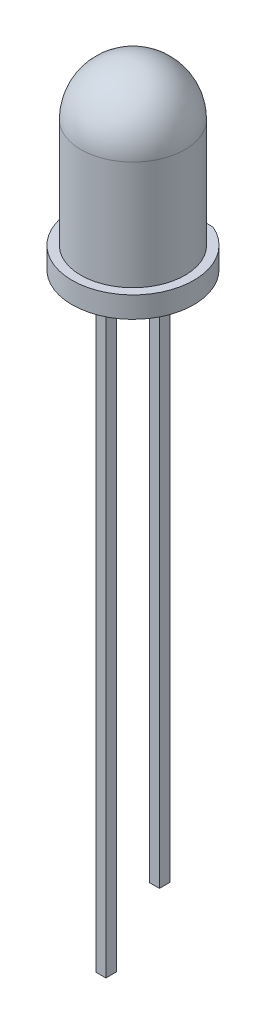
ISO-10303-21;
HEADER;
FILE_DESCRIPTION(('STEP AP214'),'2;1');
FILE_NAME('part.step','',(''),(''),'','','');
FILE_SCHEMA(('AUTOMOTIVE_DESIGN { 1 0 10303 214 1 1 1 1 }'));
ENDSEC;
DATA;
#1=APPLICATION_CONTEXT('core data for automotive mechanical design processes');
#2=APPLICATION_PROTOCOL_DEFINITION('international standard','automotive_design',2000,#1);
#3=PRODUCT_CONTEXT('',#1,'mechanical');
#4=PRODUCT('Part','Part','',(#3));
#5=PRODUCT_RELATED_PRODUCT_CATEGORY('part','',(#4));
#6=PRODUCT_DEFINITION_FORMATION('','',#4);
#7=PRODUCT_DEFINITION_CONTEXT('part definition',#1,'design');
#8=PRODUCT_DEFINITION('design','',#6,#7);
#9=PRODUCT_DEFINITION_SHAPE('','',#8);
#10=(LENGTH_UNIT() NAMED_UNIT(*) SI_UNIT(.MILLI.,.METRE.));
#11=(NAMED_UNIT(*) PLANE_ANGLE_UNIT() SI_UNIT($,.RADIAN.));
#12=(NAMED_UNIT(*) SI_UNIT($,.STERADIAN.) SOLID_ANGLE_UNIT());
#13=UNCERTAINTY_MEASURE_WITH_UNIT(LENGTH_MEASURE(1.E-05),#10,'distance_accuracy_value','');
#14=(GEOMETRIC_REPRESENTATION_CONTEXT(3) GLOBAL_UNCERTAINTY_ASSIGNED_CONTEXT((#13)) GLOBAL_UNIT_ASSIGNED_CONTEXT((#10,
#11,#12)) REPRESENTATION_CONTEXT('',''));
#15=CARTESIAN_POINT('',(0.,0.,0.));
#16=DIRECTION('',(0.,0.,1.));
#17=DIRECTION('',(1.,0.,0.));
#18=AXIS2_PLACEMENT_3D('',#15,#16,#17);
#19=CARTESIAN_POINT('',(0.,0.,0.));
#20=DIRECTION('',(0.,1.,0.));
#21=DIRECTION('',(0.,0.,1.));
#22=AXIS2_PLACEMENT_3D('',#19,#20,#21);
#23=PLANE('',#22);
#24=DIRECTION('',(0.,0.,1.));
#25=VECTOR('',#24,1.);
#26=CARTESIAN_POINT('',(0.235000000000001,0.,-1.515));
#27=LINE('',#26,#25);
#28=CARTESIAN_POINT('',(0.235000000000001,0.,-1.515));
#29=VERTEX_POINT('',#28);
#30=CARTESIAN_POINT('',(0.235000000000001,0.,-1.015));
#31=VERTEX_POINT('',#30);
#32=EDGE_CURVE('E128',#29,#31,#27,.T.);
#33=ORIENTED_EDGE('',*,*,#32,.F.);
#34=DIRECTION('',(1.,0.,0.));
#35=VECTOR('',#34,1.);
#36=CARTESIAN_POINT('',(-0.234999999999999,0.,-1.515));
#37=LINE('',#36,#35);
#38=CARTESIAN_POINT('',(-0.234999999999999,0.,-1.515));
#39=VERTEX_POINT('',#38);
#40=EDGE_CURVE('E176',#39,#29,#37,.T.);
#41=ORIENTED_EDGE('',*,*,#40,.F.);
#42=DIRECTION('',(0.,0.,-1.));
#43=VECTOR('',#42,1.);
#44=CARTESIAN_POINT('',(-0.234999999999999,0.,-1.515));
#45=LINE('',#44,#43);
#46=CARTESIAN_POINT('',(-0.234999999999999,0.,-1.015));
#47=VERTEX_POINT('',#46);
#48=EDGE_CURVE('E193',#47,#39,#45,.T.);
#49=ORIENTED_EDGE('',*,*,#48,.F.);
#50=DIRECTION('',(-1.,0.,0.));
#51=VECTOR('',#50,1.);
#52=CARTESIAN_POINT('',(-0.234999999999999,0.,-1.015));
#53=LINE('',#52,#51);
#54=EDGE_CURVE('E189',#31,#47,#53,.T.);
#55=ORIENTED_EDGE('',*,*,#54,.F.);
#56=EDGE_LOOP('',(#33,#41,#49,#55));
#57=FACE_BOUND('',#56,.T.);
#58=CARTESIAN_POINT('',(0.,0.,0.));
#59=DIRECTION('',(0.,1.,0.));
#60=DIRECTION('',(0.,0.,1.));
#61=AXIS2_PLACEMENT_3D('',#58,#59,#60);
#62=CIRCLE('',#61,2.875);
#63=CARTESIAN_POINT('',(-1.1499565209172,0.,-2.635));
#64=VERTEX_POINT('',#63);
#65=CARTESIAN_POINT('',(1.1499565209172,0.,-2.635));
#66=VERTEX_POINT('',#65);
#67=EDGE_CURVE('E218',#64,#66,#62,.T.);
#68=ORIENTED_EDGE('',*,*,#67,.F.);
#69=DIRECTION('',(-1.,0.,0.));
#70=VECTOR('',#69,1.);
#71=CARTESIAN_POINT('',(-1.1499565209172,0.,-2.635));
#72=LINE('',#71,#70);
#73=EDGE_CURVE('E225',#66,#64,#72,.T.);
#74=ORIENTED_EDGE('',*,*,#73,.F.);
#75=EDGE_LOOP('',(#68,#74));
#76=FACE_BOUND('',#75,.T.);
#77=DIRECTION('',(0.,0.,-1.));
#78=VECTOR('',#77,1.);
#79=CARTESIAN_POINT('',(-0.234999999999999,0.,1.515));
#80=LINE('',#79,#78);
#81=CARTESIAN_POINT('',(-0.234999999999999,0.,1.515));
#82=VERTEX_POINT('',#81);
#83=CARTESIAN_POINT('',(-0.234999999999999,0.,1.015));
#84=VERTEX_POINT('',#83);
#85=EDGE_CURVE('E125',#82,#84,#80,.T.);
#86=ORIENTED_EDGE('',*,*,#85,.F.);
#87=DIRECTION('',(-1.,0.,0.));
#88=VECTOR('',#87,1.);
#89=CARTESIAN_POINT('',(-0.234999999999999,0.,1.515));
#90=LINE('',#89,#88);
#91=CARTESIAN_POINT('',(0.235000000000001,0.,1.515));
#92=VERTEX_POINT('',#91);
#93=EDGE_CURVE('E158',#92,#82,#90,.T.);
#94=ORIENTED_EDGE('',*,*,#93,.F.);
#95=DIRECTION('',(0.,0.,1.));
#96=VECTOR('',#95,1.);
#97=CARTESIAN_POINT('',(0.235000000000001,0.,1.515));
#98=LINE('',#97,#96);
#99=CARTESIAN_POINT('',(0.235000000000001,0.,1.015));
#100=VERTEX_POINT('',#99);
#101=EDGE_CURVE('E61',#100,#92,#98,.T.);
#102=ORIENTED_EDGE('',*,*,#101,.F.);
#103=DIRECTION('',(1.,0.,0.));
#104=VECTOR('',#103,1.);
#105=CARTESIAN_POINT('',(-0.234999999999999,0.,1.015));
#106=LINE('',#105,#104);
#107=EDGE_CURVE('E56',#84,#100,#106,.T.);
#108=ORIENTED_EDGE('',*,*,#107,.F.);
#109=EDGE_LOOP('',(#86,#94,#102,#108));
#110=FACE_BOUND('',#109,.T.);
#111=ADVANCED_FACE('F39',(#57,#76,#110),#23,.F.);
#112=CARTESIAN_POINT('',(0.,1.,0.));
#113=DIRECTION('',(0.,-1.,0.));
#114=DIRECTION('',(0.,0.,-1.));
#115=AXIS2_PLACEMENT_3D('',#112,#113,#114);
#116=CYLINDRICAL_SURFACE('',#115,2.875);
#117=ORIENTED_EDGE('',*,*,#67,.T.);
#118=DIRECTION('',(0.,-1.,0.));
#119=VECTOR('',#118,1.);
#120=CARTESIAN_POINT('',(1.1499565209172,1.,-2.635));
#121=LINE('',#120,#119);
#122=CARTESIAN_POINT('',(1.1499565209172,1.,-2.635));
#123=VERTEX_POINT('',#122);
#124=EDGE_CURVE('E43',#123,#66,#121,.T.);
#125=ORIENTED_EDGE('',*,*,#124,.F.);
#126=CARTESIAN_POINT('',(0.,1.,0.));
#127=DIRECTION('',(0.,1.,0.));
#128=DIRECTION('',(0.,0.,1.));
#129=AXIS2_PLACEMENT_3D('',#126,#127,#128);
#130=CIRCLE('',#129,2.875);
#131=CARTESIAN_POINT('',(-1.1499565209172,1.,-2.635));
#132=VERTEX_POINT('',#131);
#133=EDGE_CURVE('E220',#132,#123,#130,.T.);
#134=ORIENTED_EDGE('',*,*,#133,.F.);
#135=DIRECTION('',(0.,-1.,0.));
#136=VECTOR('',#135,1.);
#137=CARTESIAN_POINT('',(-1.1499565209172,1.,-2.635));
#138=LINE('',#137,#136);
#139=EDGE_CURVE('E228',#132,#64,#138,.T.);
#140=ORIENTED_EDGE('',*,*,#139,.T.);
#141=EDGE_LOOP('',(#117,#125,#134,#140));
#142=FACE_BOUND('',#141,.T.);
#143=ADVANCED_FACE('F41',(#142),#116,.T.);
#144=CARTESIAN_POINT('',(-1.1499565209172,1.,-2.635));
#145=DIRECTION('',(0.,0.,1.));
#146=DIRECTION('',(1.,0.,0.));
#147=AXIS2_PLACEMENT_3D('',#144,#145,#146);
#148=PLANE('',#147);
#149=ORIENTED_EDGE('',*,*,#73,.T.);
#150=ORIENTED_EDGE('',*,*,#139,.F.);
#151=DIRECTION('',(-1.,0.,0.));
#152=VECTOR('',#151,1.);
#153=CARTESIAN_POINT('',(-1.1499565209172,1.,-2.635));
#154=LINE('',#153,#152);
#155=EDGE_CURVE('E224',#123,#132,#154,.T.);
#156=ORIENTED_EDGE('',*,*,#155,.F.);
#157=ORIENTED_EDGE('',*,*,#124,.T.);
#158=EDGE_LOOP('',(#149,#150,#156,#157));
#159=FACE_BOUND('',#158,.T.);
#160=ADVANCED_FACE('F243',(#159),#148,.F.);
#161=CARTESIAN_POINT('',(0.,1.,0.));
#162=DIRECTION('',(0.,1.,0.));
#163=DIRECTION('',(0.,0.,1.));
#164=AXIS2_PLACEMENT_3D('',#161,#162,#163);
#165=PLANE('',#164);
#166=CARTESIAN_POINT('',(0.,1.,0.));
#167=DIRECTION('',(0.,1.,0.));
#168=DIRECTION('',(0.,0.,1.));
#169=AXIS2_PLACEMENT_3D('',#166,#167,#168);
#170=CIRCLE('',#169,2.46);
#171=CARTESIAN_POINT('',(0.,1.,2.46));
#172=VERTEX_POINT('',#171);
#173=EDGE_CURVE('E11',#172,#172,#170,.T.);
#174=ORIENTED_EDGE('',*,*,#173,.F.);
#175=EDGE_LOOP('',(#174));
#176=FACE_BOUND('',#175,.T.);
#177=ORIENTED_EDGE('',*,*,#133,.T.);
#178=ORIENTED_EDGE('',*,*,#155,.T.);
#179=EDGE_LOOP('',(#177,#178));
#180=FACE_BOUND('',#179,.T.);
#181=ADVANCED_FACE('F291',(#176,#180),#165,.T.);
#182=CARTESIAN_POINT('',(0.,8.6,0.));
#183=DIRECTION('',(0.,-1.,0.));
#184=DIRECTION('',(0.,0.,-1.));
#185=AXIS2_PLACEMENT_3D('',#182,#183,#184);
#186=CYLINDRICAL_SURFACE('',#185,2.46);
#187=CARTESIAN_POINT('',(0.,6.14,0.));
#188=DIRECTION('',(0.,1.,0.));
#189=DIRECTION('',(0.,0.,1.));
#190=AXIS2_PLACEMENT_3D('',#187,#188,#189);
#191=CIRCLE('',#190,2.46);
#192=CARTESIAN_POINT('',(0.,6.14,2.46));
#193=VERTEX_POINT('',#192);
#194=EDGE_CURVE('E215',#193,#193,#191,.T.);
#195=ORIENTED_EDGE('',*,*,#194,.F.);
#196=EDGE_LOOP('',(#195));
#197=FACE_BOUND('',#196,.T.);
#198=ORIENTED_EDGE('',*,*,#173,.T.);
#199=EDGE_LOOP('',(#198));
#200=FACE_BOUND('',#199,.T.);
#201=ADVANCED_FACE('F287',(#197,#200),#186,.T.);
#202=CARTESIAN_POINT('',(0.,6.14,0.));
#203=DIRECTION('',(0.,1.,0.));
#204=DIRECTION('',(0.,0.,1.));
#205=AXIS2_PLACEMENT_3D('',#202,#203,#204);
#206=SPHERICAL_SURFACE('',#205,2.46);
#207=CARTESIAN_POINT('',(0.,8.6,0.));
#208=VERTEX_POINT('',#207);
#209=VERTEX_LOOP('',#208);
#210=FACE_BOUND('',#209,.T.);
#211=ORIENTED_EDGE('',*,*,#194,.T.);
#212=EDGE_LOOP('',(#211));
#213=FACE_BOUND('',#212,.T.);
#214=ADVANCED_FACE('F283',(#210,#213),#206,.T.);
#215=CARTESIAN_POINT('',(0.235000000000001,-25.7,-1.515));
#216=DIRECTION('',(-1.,0.,0.));
#217=DIRECTION('',(0.,0.,1.));
#218=AXIS2_PLACEMENT_3D('',#215,#216,#217);
#219=PLANE('',#218);
#220=ORIENTED_EDGE('',*,*,#32,.T.);
#221=DIRECTION('',(0.,1.,0.));
#222=VECTOR('',#221,1.);
#223=CARTESIAN_POINT('',(0.235000000000001,-25.7,-1.015));
#224=LINE('',#223,#222);
#225=CARTESIAN_POINT('',(0.235000000000001,-25.7,-1.015));
#226=VERTEX_POINT('',#225);
#227=EDGE_CURVE('E211',#226,#31,#224,.T.);
#228=ORIENTED_EDGE('',*,*,#227,.F.);
#229=DIRECTION('',(0.,0.,1.));
#230=VECTOR('',#229,1.);
#231=CARTESIAN_POINT('',(0.235000000000001,-25.7,-1.515));
#232=LINE('',#231,#230);
#233=CARTESIAN_POINT('',(0.235000000000001,-25.7,-1.515));
#234=VERTEX_POINT('',#233);
#235=EDGE_CURVE('E171',#234,#226,#232,.T.);
#236=ORIENTED_EDGE('',*,*,#235,.F.);
#237=DIRECTION('',(0.,1.,0.));
#238=VECTOR('',#237,1.);
#239=CARTESIAN_POINT('',(0.235000000000001,-25.7,-1.515));
#240=LINE('',#239,#238);
#241=EDGE_CURVE('E185',#234,#29,#240,.T.);
#242=ORIENTED_EDGE('',*,*,#241,.T.);
#243=EDGE_LOOP('',(#220,#228,#236,#242));
#244=FACE_BOUND('',#243,.T.);
#245=ADVANCED_FACE('F279',(#244),#219,.F.);
#246=CARTESIAN_POINT('',(-0.234999999999999,-25.7,-1.015));
#247=DIRECTION('',(0.,0.,-1.));
#248=DIRECTION('',(-1.,0.,0.));
#249=AXIS2_PLACEMENT_3D('',#246,#247,#248);
#250=PLANE('',#249);
#251=ORIENTED_EDGE('',*,*,#54,.T.);
#252=DIRECTION('',(0.,1.,0.));
#253=VECTOR('',#252,1.);
#254=CARTESIAN_POINT('',(-0.234999999999999,-25.7,-1.015));
#255=LINE('',#254,#253);
#256=CARTESIAN_POINT('',(-0.234999999999999,-25.7,-1.015));
#257=VERTEX_POINT('',#256);
#258=EDGE_CURVE('E207',#257,#47,#255,.T.);
#259=ORIENTED_EDGE('',*,*,#258,.F.);
#260=DIRECTION('',(-1.,0.,0.));
#261=VECTOR('',#260,1.);
#262=CARTESIAN_POINT('',(-0.234999999999999,-25.7,-1.015));
#263=LINE('',#262,#261);
#264=EDGE_CURVE('E175',#226,#257,#263,.T.);
#265=ORIENTED_EDGE('',*,*,#264,.F.);
#266=ORIENTED_EDGE('',*,*,#227,.T.);
#267=EDGE_LOOP('',(#251,#259,#265,#266));
#268=FACE_BOUND('',#267,.T.);
#269=ADVANCED_FACE('F275',(#268),#250,.F.);
#270=CARTESIAN_POINT('',(-0.234999999999999,-25.7,-1.515));
#271=DIRECTION('',(1.,0.,0.));
#272=DIRECTION('',(0.,0.,-1.));
#273=AXIS2_PLACEMENT_3D('',#270,#271,#272);
#274=PLANE('',#273);
#275=ORIENTED_EDGE('',*,*,#48,.T.);
#276=DIRECTION('',(0.,1.,0.));
#277=VECTOR('',#276,1.);
#278=CARTESIAN_POINT('',(-0.234999999999999,-25.7,-1.515));
#279=LINE('',#278,#277);
#280=CARTESIAN_POINT('',(-0.234999999999999,-25.7,-1.515));
#281=VERTEX_POINT('',#280);
#282=EDGE_CURVE('E203',#281,#39,#279,.T.);
#283=ORIENTED_EDGE('',*,*,#282,.F.);
#284=DIRECTION('',(0.,0.,-1.));
#285=VECTOR('',#284,1.);
#286=CARTESIAN_POINT('',(-0.234999999999999,-25.7,-1.515));
#287=LINE('',#286,#285);
#288=EDGE_CURVE('E179',#257,#281,#287,.T.);
#289=ORIENTED_EDGE('',*,*,#288,.F.);
#290=ORIENTED_EDGE('',*,*,#258,.T.);
#291=EDGE_LOOP('',(#275,#283,#289,#290));
#292=FACE_BOUND('',#291,.T.);
#293=ADVANCED_FACE('F271',(#292),#274,.F.);
#294=CARTESIAN_POINT('',(-0.234999999999999,-25.7,-1.515));
#295=DIRECTION('',(0.,0.,1.));
#296=DIRECTION('',(1.,0.,0.));
#297=AXIS2_PLACEMENT_3D('',#294,#295,#296);
#298=PLANE('',#297);
#299=ORIENTED_EDGE('',*,*,#40,.T.);
#300=ORIENTED_EDGE('',*,*,#241,.F.);
#301=DIRECTION('',(1.,0.,0.));
#302=VECTOR('',#301,1.);
#303=CARTESIAN_POINT('',(-0.234999999999999,-25.7,-1.515));
#304=LINE('',#303,#302);
#305=EDGE_CURVE('E182',#281,#234,#304,.T.);
#306=ORIENTED_EDGE('',*,*,#305,.F.);
#307=ORIENTED_EDGE('',*,*,#282,.T.);
#308=EDGE_LOOP('',(#299,#300,#306,#307));
#309=FACE_BOUND('',#308,.T.);
#310=ADVANCED_FACE('F267',(#309),#298,.F.);
#311=CARTESIAN_POINT('',(0.,-25.7,0.));
#312=DIRECTION('',(0.,1.,0.));
#313=DIRECTION('',(0.,0.,1.));
#314=AXIS2_PLACEMENT_3D('',#311,#312,#313);
#315=PLANE('',#314);
#316=ORIENTED_EDGE('',*,*,#235,.T.);
#317=ORIENTED_EDGE('',*,*,#264,.T.);
#318=ORIENTED_EDGE('',*,*,#288,.T.);
#319=ORIENTED_EDGE('',*,*,#305,.T.);
#320=EDGE_LOOP('',(#316,#317,#318,#319));
#321=FACE_BOUND('',#320,.T.);
#322=ADVANCED_FACE('F264',(#321),#315,.F.);
#323=CARTESIAN_POINT('',(-0.234999999999999,-25.7,1.515));
#324=DIRECTION('',(1.,0.,0.));
#325=DIRECTION('',(0.,0.,-1.));
#326=AXIS2_PLACEMENT_3D('',#323,#324,#325);
#327=PLANE('',#326);
#328=ORIENTED_EDGE('',*,*,#85,.T.);
#329=DIRECTION('',(0.,1.,0.));
#330=VECTOR('',#329,1.);
#331=CARTESIAN_POINT('',(-0.234999999999999,-25.7,1.015));
#332=LINE('',#331,#330);
#333=CARTESIAN_POINT('',(-0.234999999999999,-28.1,1.015));
#334=VERTEX_POINT('',#333);
#335=EDGE_CURVE('E119',#334,#84,#332,.T.);
#336=ORIENTED_EDGE('',*,*,#335,.F.);
#337=DIRECTION('',(0.,0.,-1.));
#338=VECTOR('',#337,1.);
#339=CARTESIAN_POINT('',(-0.234999999999999,-28.1,1.515));
#340=LINE('',#339,#338);
#341=CARTESIAN_POINT('',(-0.234999999999999,-28.1,1.515));
#342=VERTEX_POINT('',#341);
#343=EDGE_CURVE('E124',#342,#334,#340,.T.);
#344=ORIENTED_EDGE('',*,*,#343,.F.);
#345=DIRECTION('',(0.,1.,0.));
#346=VECTOR('',#345,1.);
#347=CARTESIAN_POINT('',(-0.234999999999999,-25.7,1.515));
#348=LINE('',#347,#346);
#349=EDGE_CURVE('E162',#342,#82,#348,.T.);
#350=ORIENTED_EDGE('',*,*,#349,.T.);
#351=EDGE_LOOP('',(#328,#336,#344,#350));
#352=FACE_BOUND('',#351,.T.);
#353=ADVANCED_FACE('F121',(#352),#327,.F.);
#354=CARTESIAN_POINT('',(-0.234999999999999,-25.7,1.015));
#355=DIRECTION('',(0.,0.,1.));
#356=DIRECTION('',(1.,0.,0.));
#357=AXIS2_PLACEMENT_3D('',#354,#355,#356);
#358=PLANE('',#357);
#359=ORIENTED_EDGE('',*,*,#107,.T.);
#360=DIRECTION('',(0.,1.,0.));
#361=VECTOR('',#360,1.);
#362=CARTESIAN_POINT('',(0.235000000000001,-25.7,1.015));
#363=LINE('',#362,#361);
#364=CARTESIAN_POINT('',(0.235000000000001,-28.1,1.015));
#365=VERTEX_POINT('',#364);
#366=EDGE_CURVE('E129',#365,#100,#363,.T.);
#367=ORIENTED_EDGE('',*,*,#366,.F.);
#368=DIRECTION('',(1.,0.,0.));
#369=VECTOR('',#368,1.);
#370=CARTESIAN_POINT('',(-0.234999999999999,-28.1,1.015));
#371=LINE('',#370,#369);
#372=EDGE_CURVE('E132',#334,#365,#371,.T.);
#373=ORIENTED_EDGE('',*,*,#372,.F.);
#374=ORIENTED_EDGE('',*,*,#335,.T.);
#375=EDGE_LOOP('',(#359,#367,#373,#374));
#376=FACE_BOUND('',#375,.T.);
#377=ADVANCED_FACE('F133',(#376),#358,.F.);
#378=CARTESIAN_POINT('',(0.235000000000001,-25.7,1.515));
#379=DIRECTION('',(-1.,0.,0.));
#380=DIRECTION('',(0.,0.,1.));
#381=AXIS2_PLACEMENT_3D('',#378,#379,#380);
#382=PLANE('',#381);
#383=ORIENTED_EDGE('',*,*,#101,.T.);
#384=DIRECTION('',(0.,1.,0.));
#385=VECTOR('',#384,1.);
#386=CARTESIAN_POINT('',(0.235000000000001,-25.7,1.515));
#387=LINE('',#386,#385);
#388=CARTESIAN_POINT('',(0.235000000000001,-28.1,1.515));
#389=VERTEX_POINT('',#388);
#390=EDGE_CURVE('E165',#389,#92,#387,.T.);
#391=ORIENTED_EDGE('',*,*,#390,.F.);
#392=DIRECTION('',(0.,0.,1.));
#393=VECTOR('',#392,1.);
#394=CARTESIAN_POINT('',(0.235000000000001,-28.1,1.515));
#395=LINE('',#394,#393);
#396=EDGE_CURVE('E139',#365,#389,#395,.T.);
#397=ORIENTED_EDGE('',*,*,#396,.F.);
#398=ORIENTED_EDGE('',*,*,#366,.T.);
#399=EDGE_LOOP('',(#383,#391,#397,#398));
#400=FACE_BOUND('',#399,.T.);
#401=ADVANCED_FACE('F251',(#400),#382,.F.);
#402=CARTESIAN_POINT('',(-0.234999999999999,-25.7,1.515));
#403=DIRECTION('',(0.,0.,-1.));
#404=DIRECTION('',(-1.,0.,0.));
#405=AXIS2_PLACEMENT_3D('',#402,#403,#404);
#406=PLANE('',#405);
#407=ORIENTED_EDGE('',*,*,#93,.T.);
#408=ORIENTED_EDGE('',*,*,#349,.F.);
#409=DIRECTION('',(-1.,0.,0.));
#410=VECTOR('',#409,1.);
#411=CARTESIAN_POINT('',(-0.234999999999999,-28.1,1.515));
#412=LINE('',#411,#410);
#413=EDGE_CURVE('E144',#389,#342,#412,.T.);
#414=ORIENTED_EDGE('',*,*,#413,.F.);
#415=ORIENTED_EDGE('',*,*,#390,.T.);
#416=EDGE_LOOP('',(#407,#408,#414,#415));
#417=FACE_BOUND('',#416,.T.);
#418=ADVANCED_FACE('F249',(#417),#406,.F.);
#419=CARTESIAN_POINT('',(0.,-28.1,0.));
#420=DIRECTION('',(0.,-1.,0.));
#421=DIRECTION('',(0.,0.,-1.));
#422=AXIS2_PLACEMENT_3D('',#419,#420,#421);
#423=PLANE('',#422);
#424=ORIENTED_EDGE('',*,*,#343,.T.);
#425=ORIENTED_EDGE('',*,*,#372,.T.);
#426=ORIENTED_EDGE('',*,*,#396,.T.);
#427=ORIENTED_EDGE('',*,*,#413,.T.);
#428=EDGE_LOOP('',(#424,#425,#426,#427));
#429=FACE_BOUND('',#428,.T.);
#430=ADVANCED_FACE('F142',(#429),#423,.T.);
#431=CLOSED_SHELL('',(#111,#143,#160,#181,#201,#214,#245,#269,#293,#310,#322,#353,#377,#401,
#418,#430));
#432=MANIFOLD_SOLID_BREP('B2',#431);
#433=ADVANCED_BREP_SHAPE_REPRESENTATION('',(#18,#432),#14);
#434=SHAPE_DEFINITION_REPRESENTATION(#9,#433);
ENDSEC;
END-ISO-10303-21;
